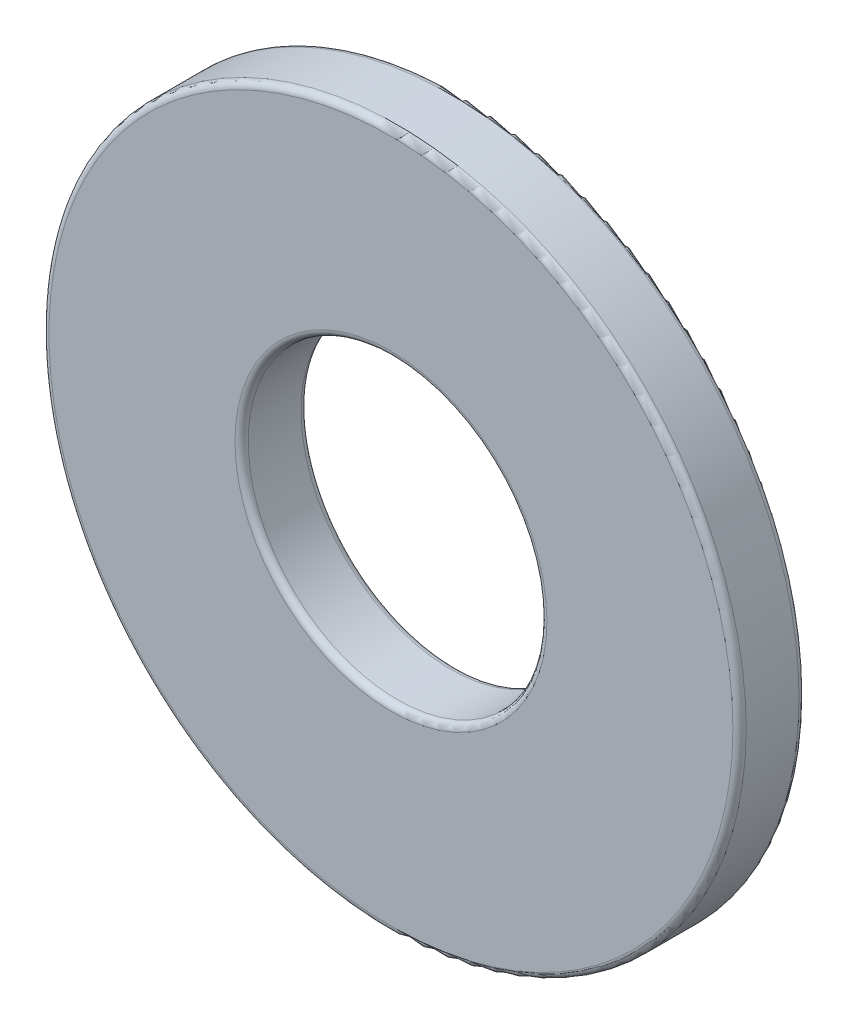
ISO-10303-21;
HEADER;
FILE_DESCRIPTION(('STEP AP214'),'2;1');
FILE_NAME('part.step','',(''),(''),'','','');
FILE_SCHEMA(('AUTOMOTIVE_DESIGN { 1 0 10303 214 1 1 1 1 }'));
ENDSEC;
DATA;
#1=APPLICATION_CONTEXT('core data for automotive mechanical design processes');
#2=APPLICATION_PROTOCOL_DEFINITION('international standard','automotive_design',2000,#1);
#3=PRODUCT_CONTEXT('',#1,'mechanical');
#4=PRODUCT('Part','Part','',(#3));
#5=PRODUCT_RELATED_PRODUCT_CATEGORY('part','',(#4));
#6=PRODUCT_DEFINITION_FORMATION('','',#4);
#7=PRODUCT_DEFINITION_CONTEXT('part definition',#1,'design');
#8=PRODUCT_DEFINITION('design','',#6,#7);
#9=PRODUCT_DEFINITION_SHAPE('','',#8);
#10=(LENGTH_UNIT() NAMED_UNIT(*) SI_UNIT(.MILLI.,.METRE.));
#11=(NAMED_UNIT(*) PLANE_ANGLE_UNIT() SI_UNIT($,.RADIAN.));
#12=(NAMED_UNIT(*) SI_UNIT($,.STERADIAN.) SOLID_ANGLE_UNIT());
#13=UNCERTAINTY_MEASURE_WITH_UNIT(LENGTH_MEASURE(1.E-05),#10,'distance_accuracy_value','');
#14=(GEOMETRIC_REPRESENTATION_CONTEXT(3) GLOBAL_UNCERTAINTY_ASSIGNED_CONTEXT((#13)) GLOBAL_UNIT_ASSIGNED_CONTEXT((#10,
#11,#12)) REPRESENTATION_CONTEXT('',''));
#15=CARTESIAN_POINT('',(0.,0.,0.));
#16=DIRECTION('',(0.,0.,1.));
#17=DIRECTION('',(1.,0.,0.));
#18=AXIS2_PLACEMENT_3D('',#15,#16,#17);
#19=CARTESIAN_POINT('',(0.,0.,-1.0541));
#20=DIRECTION('',(0.,0.,1.));
#21=DIRECTION('',(1.,0.,0.));
#22=AXIS2_PLACEMENT_3D('',#19,#20,#21);
#23=CYLINDRICAL_SURFACE('',#22,11.1125);
#24=CARTESIAN_POINT('',(0.,0.,-0.84328));
#25=DIRECTION('',(0.,0.,1.));
#26=DIRECTION('',(1.,0.,0.));
#27=AXIS2_PLACEMENT_3D('',#24,#25,#26);
#28=CIRCLE('',#27,11.1125);
#29=CARTESIAN_POINT('',(11.1125,0.,-0.84328));
#30=VERTEX_POINT('',#29);
#31=EDGE_CURVE('E56',#30,#30,#28,.T.);
#32=ORIENTED_EDGE('',*,*,#31,.T.);
#33=EDGE_LOOP('',(#32));
#34=FACE_BOUND('',#33,.T.);
#35=CARTESIAN_POINT('',(0.,0.,0.84328));
#36=DIRECTION('',(0.,0.,1.));
#37=DIRECTION('',(1.,0.,0.));
#38=AXIS2_PLACEMENT_3D('',#35,#36,#37);
#39=CIRCLE('',#38,11.1125);
#40=CARTESIAN_POINT('',(11.1125,0.,0.84328));
#41=VERTEX_POINT('',#40);
#42=EDGE_CURVE('E59',#41,#41,#39,.F.);
#43=ORIENTED_EDGE('',*,*,#42,.T.);
#44=EDGE_LOOP('',(#43));
#45=FACE_BOUND('',#44,.T.);
#46=ADVANCED_FACE('F30',(#34,#45),#23,.T.);
#47=CARTESIAN_POINT('',(0.,0.,-1.0541));
#48=DIRECTION('',(0.,0.,1.));
#49=DIRECTION('',(1.,0.,0.));
#50=AXIS2_PLACEMENT_3D('',#47,#48,#49);
#51=PLANE('',#50);
#52=CARTESIAN_POINT('',(0.,0.,-1.0541));
#53=DIRECTION('',(0.,0.,1.));
#54=DIRECTION('',(1.,0.,0.));
#55=AXIS2_PLACEMENT_3D('',#52,#53,#54);
#56=CIRCLE('',#55,10.90168);
#57=CARTESIAN_POINT('',(10.90168,0.,-1.0541));
#58=VERTEX_POINT('',#57);
#59=EDGE_CURVE('E50',#58,#58,#56,.F.);
#60=ORIENTED_EDGE('',*,*,#59,.T.);
#61=EDGE_LOOP('',(#60));
#62=FACE_BOUND('',#61,.T.);
#63=CARTESIAN_POINT('',(0.,0.,-1.0541));
#64=DIRECTION('',(0.,0.,1.));
#65=DIRECTION('',(1.,0.,0.));
#66=AXIS2_PLACEMENT_3D('',#63,#64,#65);
#67=CIRCLE('',#66,4.97332);
#68=CARTESIAN_POINT('',(4.97332,0.,-1.0541));
#69=VERTEX_POINT('',#68);
#70=EDGE_CURVE('E53',#69,#69,#67,.T.);
#71=ORIENTED_EDGE('',*,*,#70,.T.);
#72=EDGE_LOOP('',(#71));
#73=FACE_BOUND('',#72,.T.);
#74=ADVANCED_FACE('F73',(#62,#73),#51,.F.);
#75=CARTESIAN_POINT('',(0.,0.,-1.0541));
#76=DIRECTION('',(0.,0.,1.));
#77=DIRECTION('',(1.,0.,0.));
#78=AXIS2_PLACEMENT_3D('',#75,#76,#77);
#79=CYLINDRICAL_SURFACE('',#78,4.7625);
#80=CARTESIAN_POINT('',(0.,0.,-0.84328));
#81=DIRECTION('',(0.,0.,1.));
#82=DIRECTION('',(1.,0.,0.));
#83=AXIS2_PLACEMENT_3D('',#80,#81,#82);
#84=CIRCLE('',#83,4.7625);
#85=CARTESIAN_POINT('',(4.7625,0.,-0.84328));
#86=VERTEX_POINT('',#85);
#87=EDGE_CURVE('E41',#86,#86,#84,.F.);
#88=ORIENTED_EDGE('',*,*,#87,.T.);
#89=EDGE_LOOP('',(#88));
#90=FACE_BOUND('',#89,.T.);
#91=CARTESIAN_POINT('',(0.,0.,0.84328));
#92=DIRECTION('',(0.,0.,1.));
#93=DIRECTION('',(1.,0.,0.));
#94=AXIS2_PLACEMENT_3D('',#91,#92,#93);
#95=CIRCLE('',#94,4.7625);
#96=CARTESIAN_POINT('',(4.7625,0.,0.84328));
#97=VERTEX_POINT('',#96);
#98=EDGE_CURVE('E45',#97,#97,#95,.T.);
#99=ORIENTED_EDGE('',*,*,#98,.T.);
#100=EDGE_LOOP('',(#99));
#101=FACE_BOUND('',#100,.T.);
#102=ADVANCED_FACE('F79',(#90,#101),#79,.F.);
#103=CARTESIAN_POINT('',(0.,0.,1.0541));
#104=DIRECTION('',(0.,0.,1.));
#105=DIRECTION('',(1.,0.,0.));
#106=AXIS2_PLACEMENT_3D('',#103,#104,#105);
#107=PLANE('',#106);
#108=CARTESIAN_POINT('',(0.,0.,1.0541));
#109=DIRECTION('',(0.,0.,1.));
#110=DIRECTION('',(1.,0.,0.));
#111=AXIS2_PLACEMENT_3D('',#108,#109,#110);
#112=CIRCLE('',#111,4.97332);
#113=CARTESIAN_POINT('',(4.97332,0.,1.0541));
#114=VERTEX_POINT('',#113);
#115=EDGE_CURVE('E10',#114,#114,#112,.F.);
#116=ORIENTED_EDGE('',*,*,#115,.T.);
#117=EDGE_LOOP('',(#116));
#118=FACE_BOUND('',#117,.T.);
#119=CARTESIAN_POINT('',(0.,0.,1.0541));
#120=DIRECTION('',(0.,0.,1.));
#121=DIRECTION('',(1.,0.,0.));
#122=AXIS2_PLACEMENT_3D('',#119,#120,#121);
#123=CIRCLE('',#122,10.90168);
#124=CARTESIAN_POINT('',(10.90168,0.,1.0541));
#125=VERTEX_POINT('',#124);
#126=EDGE_CURVE('E37',#125,#125,#123,.T.);
#127=ORIENTED_EDGE('',*,*,#126,.T.);
#128=EDGE_LOOP('',(#127));
#129=FACE_BOUND('',#128,.T.);
#130=ADVANCED_FACE('F87',(#118,#129),#107,.T.);
#131=CARTESIAN_POINT('',(0.,0.,-0.84328));
#132=DIRECTION('',(0.,0.,1.));
#133=DIRECTION('',(1.,0.,0.));
#134=AXIS2_PLACEMENT_3D('',#131,#132,#133);
#135=TOROIDAL_SURFACE('',#134,10.90168,0.21082);
#136=ORIENTED_EDGE('',*,*,#59,.F.);
#137=EDGE_LOOP('',(#136));
#138=FACE_BOUND('',#137,.T.);
#139=ORIENTED_EDGE('',*,*,#31,.F.);
#140=EDGE_LOOP('',(#139));
#141=FACE_BOUND('',#140,.T.);
#142=ADVANCED_FACE('F84',(#138,#141),#135,.T.);
#143=CARTESIAN_POINT('',(0.,0.,-0.84328));
#144=DIRECTION('',(0.,0.,1.));
#145=DIRECTION('',(1.,0.,0.));
#146=AXIS2_PLACEMENT_3D('',#143,#144,#145);
#147=TOROIDAL_SURFACE('',#146,4.97332,0.21082);
#148=ORIENTED_EDGE('',*,*,#87,.F.);
#149=EDGE_LOOP('',(#148));
#150=FACE_BOUND('',#149,.T.);
#151=ORIENTED_EDGE('',*,*,#70,.F.);
#152=EDGE_LOOP('',(#151));
#153=FACE_BOUND('',#152,.T.);
#154=ADVANCED_FACE('F70',(#150,#153),#147,.T.);
#155=CARTESIAN_POINT('',(0.,0.,0.84328));
#156=DIRECTION('',(0.,0.,1.));
#157=DIRECTION('',(1.,0.,0.));
#158=AXIS2_PLACEMENT_3D('',#155,#156,#157);
#159=TOROIDAL_SURFACE('',#158,4.97332,0.21082);
#160=ORIENTED_EDGE('',*,*,#115,.F.);
#161=EDGE_LOOP('',(#160));
#162=FACE_BOUND('',#161,.T.);
#163=ORIENTED_EDGE('',*,*,#98,.F.);
#164=EDGE_LOOP('',(#163));
#165=FACE_BOUND('',#164,.T.);
#166=ADVANCED_FACE('F66',(#162,#165),#159,.T.);
#167=CARTESIAN_POINT('',(0.,0.,0.84328));
#168=DIRECTION('',(0.,0.,1.));
#169=DIRECTION('',(1.,0.,0.));
#170=AXIS2_PLACEMENT_3D('',#167,#168,#169);
#171=TOROIDAL_SURFACE('',#170,10.90168,0.21082);
#172=ORIENTED_EDGE('',*,*,#42,.F.);
#173=EDGE_LOOP('',(#172));
#174=FACE_BOUND('',#173,.T.);
#175=ORIENTED_EDGE('',*,*,#126,.F.);
#176=EDGE_LOOP('',(#175));
#177=FACE_BOUND('',#176,.T.);
#178=ADVANCED_FACE('F32',(#174,#177),#171,.T.);
#179=CLOSED_SHELL('',(#46,#74,#102,#130,#142,#154,#166,#178));
#180=MANIFOLD_SOLID_BREP('B2',#179);
#181=ADVANCED_BREP_SHAPE_REPRESENTATION('',(#18,#180),#14);
#182=SHAPE_DEFINITION_REPRESENTATION(#9,#181);
ENDSEC;
END-ISO-10303-21;
